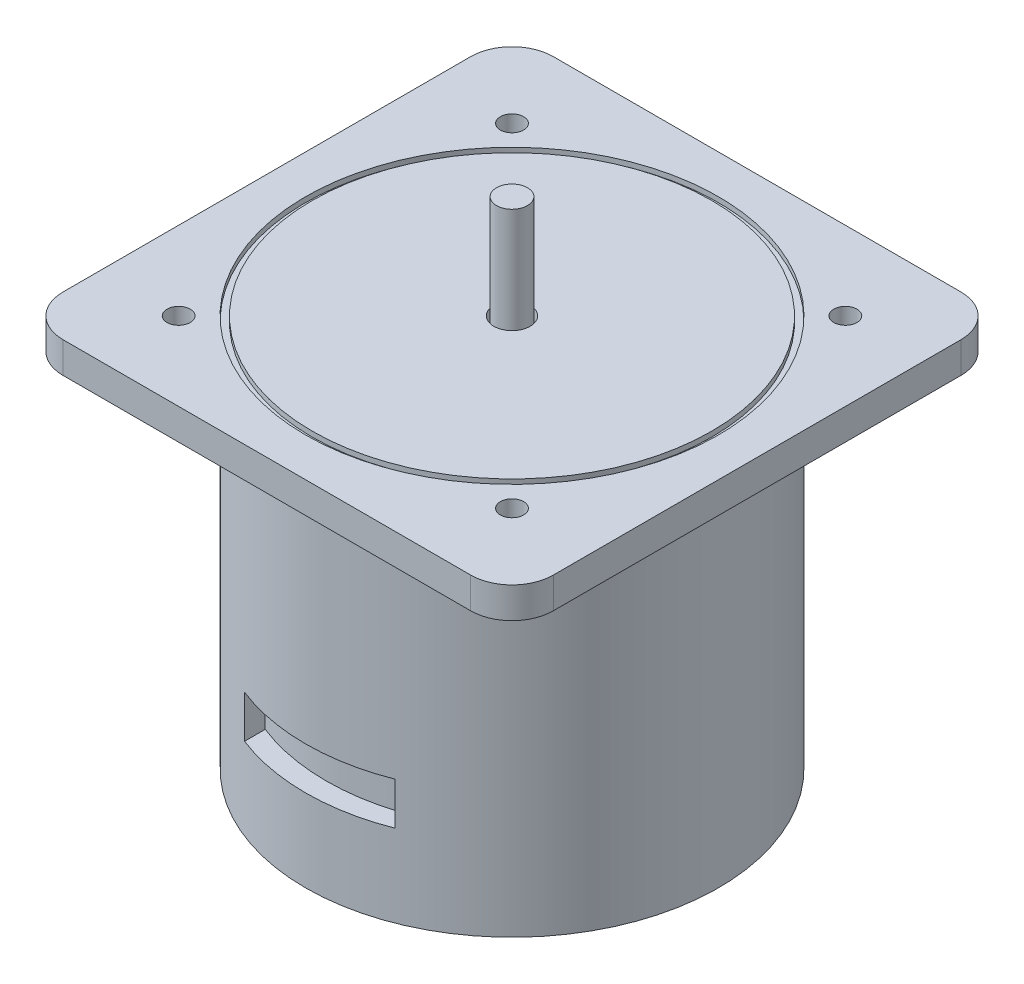
ISO-10303-21;
HEADER;
FILE_DESCRIPTION(('STEP AP214'),'2;1');
FILE_NAME('part.step','',(''),(''),'','','');
FILE_SCHEMA(('AUTOMOTIVE_DESIGN { 1 0 10303 214 1 1 1 1 }'));
ENDSEC;
DATA;
#1=APPLICATION_CONTEXT('core data for automotive mechanical design processes');
#2=APPLICATION_PROTOCOL_DEFINITION('international standard','automotive_design',2000,#1);
#3=PRODUCT_CONTEXT('',#1,'mechanical');
#4=PRODUCT('Part','Part','',(#3));
#5=PRODUCT_RELATED_PRODUCT_CATEGORY('part','',(#4));
#6=PRODUCT_DEFINITION_FORMATION('','',#4);
#7=PRODUCT_DEFINITION_CONTEXT('part definition',#1,'design');
#8=PRODUCT_DEFINITION('design','',#6,#7);
#9=PRODUCT_DEFINITION_SHAPE('','',#8);
#10=(LENGTH_UNIT() NAMED_UNIT(*) SI_UNIT(.MILLI.,.METRE.));
#11=(NAMED_UNIT(*) PLANE_ANGLE_UNIT() SI_UNIT($,.RADIAN.));
#12=(NAMED_UNIT(*) SI_UNIT($,.STERADIAN.) SOLID_ANGLE_UNIT());
#13=UNCERTAINTY_MEASURE_WITH_UNIT(LENGTH_MEASURE(1.E-05),#10,'distance_accuracy_value','');
#14=(GEOMETRIC_REPRESENTATION_CONTEXT(3) GLOBAL_UNCERTAINTY_ASSIGNED_CONTEXT((#13)) GLOBAL_UNIT_ASSIGNED_CONTEXT((#10,
#11,#12)) REPRESENTATION_CONTEXT('',''));
#15=CARTESIAN_POINT('',(0.,0.,0.));
#16=DIRECTION('',(0.,0.,1.));
#17=DIRECTION('',(1.,0.,0.));
#18=AXIS2_PLACEMENT_3D('',#15,#16,#17);
#19=CARTESIAN_POINT('',(0.,0.,0.));
#20=DIRECTION('',(0.,1.,0.));
#21=DIRECTION('',(0.,0.,1.));
#22=AXIS2_PLACEMENT_3D('',#19,#20,#21);
#23=PLANE('',#22);
#24=CARTESIAN_POINT('',(22.4964510362882,0.,0.));
#25=DIRECTION('',(0.,1.,0.));
#26=DIRECTION('',(0.,0.,-1.));
#27=AXIS2_PLACEMENT_3D('',#24,#25,#26);
#28=CIRCLE('',#27,5.38478881187688);
#29=CARTESIAN_POINT('',(25.6226762505398,0.,-4.38436614099365));
#30=VERTEX_POINT('',#29);
#31=CARTESIAN_POINT('',(25.77290034815,0.,4.27326929356368));
#32=VERTEX_POINT('',#31);
#33=EDGE_CURVE('E205',#30,#32,#28,.F.);
#34=ORIENTED_EDGE('',*,*,#33,.T.);
#35=DIRECTION('',(0.608463846276613,0.,0.793581594906454));
#36=VECTOR('',#35,1.);
#37=CARTESIAN_POINT('',(14.1676292878415,0.,-10.862764792469));
#38=LINE('',#37,#36);
#39=CARTESIAN_POINT('',(27.3190931834106,0.,6.28987255396704));
#40=VERTEX_POINT('',#39);
#41=EDGE_CURVE('E179',#32,#40,#38,.T.);
#42=ORIENTED_EDGE('',*,*,#41,.T.);
#43=CARTESIAN_POINT('',(22.4964510362882,0.,0.));
#44=DIRECTION('',(0.,1.,0.));
#45=DIRECTION('',(0.,0.,-1.));
#46=AXIS2_PLACEMENT_3D('',#43,#44,#45);
#47=CIRCLE('',#46,7.92593048318929);
#48=CARTESIAN_POINT('',(27.0979766649814,0.,-6.45339723810865));
#49=VERTEX_POINT('',#48);
#50=EDGE_CURVE('E193',#40,#49,#47,.T.);
#51=ORIENTED_EDGE('',*,*,#50,.T.);
#52=DIRECTION('',(0.58056598382398,0.,-0.814213202070867));
#53=VECTOR('',#52,1.);
#54=CARTESIAN_POINT('',(14.9138678534548,0.,10.634173384735));
#55=LINE('',#54,#53);
#56=EDGE_CURVE('E51',#30,#49,#55,.T.);
#57=ORIENTED_EDGE('',*,*,#56,.F.);
#58=EDGE_LOOP('',(#34,#42,#51,#57));
#59=FACE_BOUND('',#58,.T.);
#60=CARTESIAN_POINT('',(0.,0.,0.));
#61=DIRECTION('',(0.,1.,0.));
#62=DIRECTION('',(0.,0.,1.));
#63=AXIS2_PLACEMENT_3D('',#60,#61,#62);
#64=CIRCLE('',#63,40.);
#65=CARTESIAN_POINT('',(0.,0.,40.));
#66=VERTEX_POINT('',#65);
#67=EDGE_CURVE('E313',#66,#66,#64,.T.);
#68=ORIENTED_EDGE('',*,*,#67,.F.);
#69=EDGE_LOOP('',(#68));
#70=FACE_BOUND('',#69,.T.);
#71=DIRECTION('',(-0.608463846276613,0.,0.793581594906454));
#72=VECTOR('',#71,1.);
#73=CARTESIAN_POINT('',(-14.1676292878415,0.,-10.862764792469));
#74=LINE('',#73,#72);
#75=CARTESIAN_POINT('',(-25.77290034815,0.,4.27326929356368));
#76=VERTEX_POINT('',#75);
#77=CARTESIAN_POINT('',(-27.3190931834106,0.,6.28987255396704));
#78=VERTEX_POINT('',#77);
#79=EDGE_CURVE('E184',#76,#78,#74,.T.);
#80=ORIENTED_EDGE('',*,*,#79,.F.);
#81=CARTESIAN_POINT('',(-22.4964510362882,0.,0.));
#82=DIRECTION('',(0.,-1.,0.));
#83=DIRECTION('',(0.,0.,-1.));
#84=AXIS2_PLACEMENT_3D('',#81,#82,#83);
#85=CIRCLE('',#84,5.38478881187688);
#86=CARTESIAN_POINT('',(-25.6226762505398,0.,-4.38436614099365));
#87=VERTEX_POINT('',#86);
#88=EDGE_CURVE('E218',#87,#76,#85,.F.);
#89=ORIENTED_EDGE('',*,*,#88,.F.);
#90=DIRECTION('',(-0.58056598382398,0.,-0.814213202070867));
#91=VECTOR('',#90,1.);
#92=CARTESIAN_POINT('',(-14.9138678534548,0.,10.634173384735));
#93=LINE('',#92,#91);
#94=CARTESIAN_POINT('',(-27.0979766649814,0.,-6.45339723810865));
#95=VERTEX_POINT('',#94);
#96=EDGE_CURVE('E229',#87,#95,#93,.T.);
#97=ORIENTED_EDGE('',*,*,#96,.T.);
#98=CARTESIAN_POINT('',(-22.4964510362882,0.,0.));
#99=DIRECTION('',(0.,-1.,0.));
#100=DIRECTION('',(0.,0.,-1.));
#101=AXIS2_PLACEMENT_3D('',#98,#99,#100);
#102=CIRCLE('',#101,7.92593048318929);
#103=EDGE_CURVE('E59',#78,#95,#102,.T.);
#104=ORIENTED_EDGE('',*,*,#103,.F.);
#105=EDGE_LOOP('',(#80,#89,#97,#104));
#106=FACE_BOUND('',#105,.T.);
#107=ADVANCED_FACE('F34',(#59,#70,#106),#23,.F.);
#108=CARTESIAN_POINT('',(0.,70.,0.));
#109=DIRECTION('',(0.,-1.,0.));
#110=DIRECTION('',(0.,0.,-1.));
#111=AXIS2_PLACEMENT_3D('',#108,#109,#110);
#112=CYLINDRICAL_SURFACE('',#111,40.);
#113=ORIENTED_EDGE('',*,*,#67,.T.);
#114=EDGE_LOOP('',(#113));
#115=FACE_BOUND('',#114,.T.);
#116=CARTESIAN_POINT('',(0.,70.,0.));
#117=DIRECTION('',(0.,1.,0.));
#118=DIRECTION('',(0.,0.,1.));
#119=AXIS2_PLACEMENT_3D('',#116,#117,#118);
#120=CIRCLE('',#119,40.);
#121=CARTESIAN_POINT('',(0.,70.,40.));
#122=VERTEX_POINT('',#121);
#123=EDGE_CURVE('E324',#122,#122,#120,.T.);
#124=ORIENTED_EDGE('',*,*,#123,.F.);
#125=EDGE_LOOP('',(#124));
#126=FACE_BOUND('',#125,.T.);
#127=DIRECTION('',(0.,-1.,0.));
#128=VECTOR('',#127,1.);
#129=CARTESIAN_POINT('',(-14.5735687844263,70.,37.2506522477875));
#130=LINE('',#129,#128);
#131=CARTESIAN_POINT('',(-14.5735687844263,24.166302971847,37.2506522477875));
#132=VERTEX_POINT('',#131);
#133=CARTESIAN_POINT('',(-14.5735687844263,15.945315452427,37.2506522477875));
#134=VERTEX_POINT('',#133);
#135=EDGE_CURVE('E257',#132,#134,#130,.T.);
#136=ORIENTED_EDGE('',*,*,#135,.F.);
#137=CARTESIAN_POINT('',(0.,24.166302971847,0.));
#138=DIRECTION('',(0.,-1.,0.));
#139=DIRECTION('',(0.,0.,-1.));
#140=AXIS2_PLACEMENT_3D('',#137,#138,#139);
#141=CIRCLE('',#140,40.);
#142=CARTESIAN_POINT('',(14.5735687844263,24.166302971847,37.2506522477875));
#143=VERTEX_POINT('',#142);
#144=EDGE_CURVE('E253',#143,#132,#141,.T.);
#145=ORIENTED_EDGE('',*,*,#144,.F.);
#146=DIRECTION('',(0.,-1.,0.));
#147=VECTOR('',#146,1.);
#148=CARTESIAN_POINT('',(14.5735687844263,70.,37.2506522477875));
#149=LINE('',#148,#147);
#150=CARTESIAN_POINT('',(14.5735687844263,15.945315452427,37.2506522477875));
#151=VERTEX_POINT('',#150);
#152=EDGE_CURVE('E248',#143,#151,#149,.T.);
#153=ORIENTED_EDGE('',*,*,#152,.T.);
#154=CARTESIAN_POINT('',(0.,15.945315452427,0.));
#155=DIRECTION('',(0.,1.,0.));
#156=DIRECTION('',(0.,0.,1.));
#157=AXIS2_PLACEMENT_3D('',#154,#155,#156);
#158=CIRCLE('',#157,40.);
#159=EDGE_CURVE('E244',#134,#151,#158,.T.);
#160=ORIENTED_EDGE('',*,*,#159,.F.);
#161=EDGE_LOOP('',(#136,#145,#153,#160));
#162=FACE_BOUND('',#161,.T.);
#163=ADVANCED_FACE('F391',(#115,#126,#162),#112,.T.);
#164=CARTESIAN_POINT('',(47.5,76.,-47.5));
#165=DIRECTION('',(-1.,0.,0.));
#166=DIRECTION('',(0.,0.,1.));
#167=AXIS2_PLACEMENT_3D('',#164,#165,#166);
#168=PLANE('',#167);
#169=DIRECTION('',(0.,0.,-1.));
#170=VECTOR('',#169,1.);
#171=CARTESIAN_POINT('',(47.5,76.,-47.5));
#172=LINE('',#171,#170);
#173=CARTESIAN_POINT('',(47.5,76.,39.5));
#174=VERTEX_POINT('',#173);
#175=CARTESIAN_POINT('',(47.5,76.,-39.5));
#176=VERTEX_POINT('',#175);
#177=EDGE_CURVE('E300',#174,#176,#172,.T.);
#178=ORIENTED_EDGE('',*,*,#177,.F.);
#179=DIRECTION('',(0.,-1.,0.));
#180=VECTOR('',#179,1.);
#181=CARTESIAN_POINT('',(47.5,76.,39.5));
#182=LINE('',#181,#180);
#183=CARTESIAN_POINT('',(47.5,70.,39.5));
#184=VERTEX_POINT('',#183);
#185=EDGE_CURVE('E331',#174,#184,#182,.T.);
#186=ORIENTED_EDGE('',*,*,#185,.T.);
#187=DIRECTION('',(0.,0.,-1.));
#188=VECTOR('',#187,1.);
#189=CARTESIAN_POINT('',(47.5,70.,-47.5));
#190=LINE('',#189,#188);
#191=CARTESIAN_POINT('',(47.5,70.,-39.5));
#192=VERTEX_POINT('',#191);
#193=EDGE_CURVE('E297',#184,#192,#190,.T.);
#194=ORIENTED_EDGE('',*,*,#193,.T.);
#195=DIRECTION('',(0.,-1.,0.));
#196=VECTOR('',#195,1.);
#197=CARTESIAN_POINT('',(47.5,76.,-39.5));
#198=LINE('',#197,#196);
#199=EDGE_CURVE('E327',#192,#176,#198,.F.);
#200=ORIENTED_EDGE('',*,*,#199,.T.);
#201=EDGE_LOOP('',(#178,#186,#194,#200));
#202=FACE_BOUND('',#201,.T.);
#203=ADVANCED_FACE('F397',(#202),#168,.F.);
#204=CARTESIAN_POINT('',(-47.5,76.,-47.5));
#205=DIRECTION('',(0.,0.,1.));
#206=DIRECTION('',(1.,0.,0.));
#207=AXIS2_PLACEMENT_3D('',#204,#205,#206);
#208=PLANE('',#207);
#209=DIRECTION('',(-1.,0.,0.));
#210=VECTOR('',#209,1.);
#211=CARTESIAN_POINT('',(-47.5,70.,-47.5));
#212=LINE('',#211,#210);
#213=CARTESIAN_POINT('',(39.5,70.,-47.5));
#214=VERTEX_POINT('',#213);
#215=CARTESIAN_POINT('',(-39.5,70.,-47.5));
#216=VERTEX_POINT('',#215);
#217=EDGE_CURVE('E316',#214,#216,#212,.T.);
#218=ORIENTED_EDGE('',*,*,#217,.T.);
#219=DIRECTION('',(0.,-1.,0.));
#220=VECTOR('',#219,1.);
#221=CARTESIAN_POINT('',(-39.5,76.,-47.5));
#222=LINE('',#221,#220);
#223=CARTESIAN_POINT('',(-39.5,76.,-47.5));
#224=VERTEX_POINT('',#223);
#225=EDGE_CURVE('E11',#216,#224,#222,.F.);
#226=ORIENTED_EDGE('',*,*,#225,.T.);
#227=DIRECTION('',(-1.,0.,0.));
#228=VECTOR('',#227,1.);
#229=CARTESIAN_POINT('',(-47.5,76.,-47.5));
#230=LINE('',#229,#228);
#231=CARTESIAN_POINT('',(39.5,76.,-47.5));
#232=VERTEX_POINT('',#231);
#233=EDGE_CURVE('E303',#232,#224,#230,.T.);
#234=ORIENTED_EDGE('',*,*,#233,.F.);
#235=DIRECTION('',(0.,-1.,0.));
#236=VECTOR('',#235,1.);
#237=CARTESIAN_POINT('',(39.5,76.,-47.5));
#238=LINE('',#237,#236);
#239=EDGE_CURVE('E43',#232,#214,#238,.T.);
#240=ORIENTED_EDGE('',*,*,#239,.T.);
#241=EDGE_LOOP('',(#218,#226,#234,#240));
#242=FACE_BOUND('',#241,.T.);
#243=ADVANCED_FACE('F447',(#242),#208,.F.);
#244=CARTESIAN_POINT('',(-47.5,76.,-47.5));
#245=DIRECTION('',(1.,0.,0.));
#246=DIRECTION('',(0.,0.,-1.));
#247=AXIS2_PLACEMENT_3D('',#244,#245,#246);
#248=PLANE('',#247);
#249=DIRECTION('',(0.,0.,1.));
#250=VECTOR('',#249,1.);
#251=CARTESIAN_POINT('',(-47.5,70.,-47.5));
#252=LINE('',#251,#250);
#253=CARTESIAN_POINT('',(-47.5,70.,-39.5));
#254=VERTEX_POINT('',#253);
#255=CARTESIAN_POINT('',(-47.5,70.,39.5));
#256=VERTEX_POINT('',#255);
#257=EDGE_CURVE('E319',#254,#256,#252,.T.);
#258=ORIENTED_EDGE('',*,*,#257,.T.);
#259=DIRECTION('',(0.,-1.,0.));
#260=VECTOR('',#259,1.);
#261=CARTESIAN_POINT('',(-47.5,76.,39.5));
#262=LINE('',#261,#260);
#263=CARTESIAN_POINT('',(-47.5,76.,39.5));
#264=VERTEX_POINT('',#263);
#265=EDGE_CURVE('E358',#256,#264,#262,.F.);
#266=ORIENTED_EDGE('',*,*,#265,.T.);
#267=DIRECTION('',(0.,0.,1.));
#268=VECTOR('',#267,1.);
#269=CARTESIAN_POINT('',(-47.5,76.,-47.5));
#270=LINE('',#269,#268);
#271=CARTESIAN_POINT('',(-47.5,76.,-39.5));
#272=VERTEX_POINT('',#271);
#273=EDGE_CURVE('E307',#272,#264,#270,.T.);
#274=ORIENTED_EDGE('',*,*,#273,.F.);
#275=DIRECTION('',(0.,-1.,0.));
#276=VECTOR('',#275,1.);
#277=CARTESIAN_POINT('',(-47.5,76.,-39.5));
#278=LINE('',#277,#276);
#279=EDGE_CURVE('E355',#272,#254,#278,.T.);
#280=ORIENTED_EDGE('',*,*,#279,.T.);
#281=EDGE_LOOP('',(#258,#266,#274,#280));
#282=FACE_BOUND('',#281,.T.);
#283=ADVANCED_FACE('F429',(#282),#248,.F.);
#284=CARTESIAN_POINT('',(-47.5,76.,47.5));
#285=DIRECTION('',(0.,0.,-1.));
#286=DIRECTION('',(-1.,0.,0.));
#287=AXIS2_PLACEMENT_3D('',#284,#285,#286);
#288=PLANE('',#287);
#289=DIRECTION('',(1.,0.,0.));
#290=VECTOR('',#289,1.);
#291=CARTESIAN_POINT('',(-47.5,70.,47.5));
#292=LINE('',#291,#290);
#293=CARTESIAN_POINT('',(-39.5,70.,47.5));
#294=VERTEX_POINT('',#293);
#295=CARTESIAN_POINT('',(39.5,70.,47.5));
#296=VERTEX_POINT('',#295);
#297=EDGE_CURVE('E304',#294,#296,#292,.T.);
#298=ORIENTED_EDGE('',*,*,#297,.T.);
#299=DIRECTION('',(0.,-1.,0.));
#300=VECTOR('',#299,1.);
#301=CARTESIAN_POINT('',(39.5,76.,47.5));
#302=LINE('',#301,#300);
#303=CARTESIAN_POINT('',(39.5,76.,47.5));
#304=VERTEX_POINT('',#303);
#305=EDGE_CURVE('E345',#296,#304,#302,.F.);
#306=ORIENTED_EDGE('',*,*,#305,.T.);
#307=DIRECTION('',(1.,0.,0.));
#308=VECTOR('',#307,1.);
#309=CARTESIAN_POINT('',(-47.5,76.,47.5));
#310=LINE('',#309,#308);
#311=CARTESIAN_POINT('',(-39.5,76.,47.5));
#312=VERTEX_POINT('',#311);
#313=EDGE_CURVE('E310',#312,#304,#310,.T.);
#314=ORIENTED_EDGE('',*,*,#313,.F.);
#315=DIRECTION('',(0.,-1.,0.));
#316=VECTOR('',#315,1.);
#317=CARTESIAN_POINT('',(-39.5,76.,47.5));
#318=LINE('',#317,#316);
#319=EDGE_CURVE('E342',#312,#294,#318,.T.);
#320=ORIENTED_EDGE('',*,*,#319,.T.);
#321=EDGE_LOOP('',(#298,#306,#314,#320));
#322=FACE_BOUND('',#321,.T.);
#323=ADVANCED_FACE('F436',(#322),#288,.F.);
#324=CARTESIAN_POINT('',(0.,76.,0.));
#325=DIRECTION('',(0.,1.,0.));
#326=DIRECTION('',(0.,0.,1.));
#327=AXIS2_PLACEMENT_3D('',#324,#325,#326);
#328=PLANE('',#327);
#329=CARTESIAN_POINT('',(-32.2955996908533,76.,32.2955996908551));
#330=DIRECTION('',(0.,1.,0.));
#331=DIRECTION('',(0.,0.,1.));
#332=AXIS2_PLACEMENT_3D('',#329,#330,#331);
#333=CIRCLE('',#332,2.25);
#334=CARTESIAN_POINT('',(-32.2955996908533,76.,34.5455996908551));
#335=VERTEX_POINT('',#334);
#336=EDGE_CURVE('E702',#335,#335,#333,.T.);
#337=ORIENTED_EDGE('',*,*,#336,.F.);
#338=EDGE_LOOP('',(#337));
#339=FACE_BOUND('',#338,.T.);
#340=CARTESIAN_POINT('',(32.295599690857,76.,32.2955996908533));
#341=DIRECTION('',(0.,1.,0.));
#342=DIRECTION('',(0.,0.,1.));
#343=AXIS2_PLACEMENT_3D('',#340,#341,#342);
#344=CIRCLE('',#343,2.25);
#345=CARTESIAN_POINT('',(32.295599690857,76.,34.5455996908533));
#346=VERTEX_POINT('',#345);
#347=EDGE_CURVE('E698',#346,#346,#344,.T.);
#348=ORIENTED_EDGE('',*,*,#347,.F.);
#349=EDGE_LOOP('',(#348));
#350=FACE_BOUND('',#349,.T.);
#351=CARTESIAN_POINT('',(32.2955996908551,76.,-32.295599690857));
#352=DIRECTION('',(0.,1.,0.));
#353=DIRECTION('',(0.,0.,1.));
#354=AXIS2_PLACEMENT_3D('',#351,#352,#353);
#355=CIRCLE('',#354,2.25);
#356=CARTESIAN_POINT('',(32.2955996908551,76.,-30.045599690857));
#357=VERTEX_POINT('',#356);
#358=EDGE_CURVE('E679',#357,#357,#355,.T.);
#359=ORIENTED_EDGE('',*,*,#358,.F.);
#360=EDGE_LOOP('',(#359));
#361=FACE_BOUND('',#360,.T.);
#362=CARTESIAN_POINT('',(-32.2955996908551,76.,-32.2955996908551));
#363=DIRECTION('',(0.,1.,0.));
#364=DIRECTION('',(0.,0.,1.));
#365=AXIS2_PLACEMENT_3D('',#362,#363,#364);
#366=CIRCLE('',#365,2.25);
#367=CARTESIAN_POINT('',(-32.2955996908551,76.,-30.0455996908551));
#368=VERTEX_POINT('',#367);
#369=EDGE_CURVE('E366',#368,#368,#366,.T.);
#370=ORIENTED_EDGE('',*,*,#369,.F.);
#371=EDGE_LOOP('',(#370));
#372=FACE_BOUND('',#371,.T.);
#373=CARTESIAN_POINT('',(0.,76.,0.));
#374=DIRECTION('',(0.,1.,0.));
#375=DIRECTION('',(0.,0.,1.));
#376=AXIS2_PLACEMENT_3D('',#373,#374,#375);
#377=CIRCLE('',#376,40.);
#378=CARTESIAN_POINT('',(0.,76.,40.));
#379=VERTEX_POINT('',#378);
#380=EDGE_CURVE('E291',#379,#379,#377,.T.);
#381=ORIENTED_EDGE('',*,*,#380,.F.);
#382=EDGE_LOOP('',(#381));
#383=FACE_BOUND('',#382,.T.);
#384=ORIENTED_EDGE('',*,*,#313,.T.);
#385=CARTESIAN_POINT('',(39.5,76.,39.5));
#386=DIRECTION('',(0.,1.,0.));
#387=DIRECTION('',(0.,0.,1.));
#388=AXIS2_PLACEMENT_3D('',#385,#386,#387);
#389=CIRCLE('',#388,8.);
#390=EDGE_CURVE('E353',#304,#174,#389,.T.);
#391=ORIENTED_EDGE('',*,*,#390,.T.);
#392=ORIENTED_EDGE('',*,*,#177,.T.);
#393=CARTESIAN_POINT('',(39.5,76.,-39.5));
#394=DIRECTION('',(0.,1.,0.));
#395=DIRECTION('',(0.,0.,1.));
#396=AXIS2_PLACEMENT_3D('',#393,#394,#395);
#397=CIRCLE('',#396,8.);
#398=EDGE_CURVE('E347',#176,#232,#397,.T.);
#399=ORIENTED_EDGE('',*,*,#398,.T.);
#400=ORIENTED_EDGE('',*,*,#233,.T.);
#401=CARTESIAN_POINT('',(-39.5,76.,-39.5));
#402=DIRECTION('',(0.,1.,0.));
#403=DIRECTION('',(0.,0.,1.));
#404=AXIS2_PLACEMENT_3D('',#401,#402,#403);
#405=CIRCLE('',#404,8.);
#406=EDGE_CURVE('E349',#224,#272,#405,.T.);
#407=ORIENTED_EDGE('',*,*,#406,.T.);
#408=ORIENTED_EDGE('',*,*,#273,.T.);
#409=CARTESIAN_POINT('',(-39.5,76.,39.5));
#410=DIRECTION('',(0.,1.,0.));
#411=DIRECTION('',(0.,0.,1.));
#412=AXIS2_PLACEMENT_3D('',#409,#410,#411);
#413=CIRCLE('',#412,8.);
#414=EDGE_CURVE('E351',#264,#312,#413,.T.);
#415=ORIENTED_EDGE('',*,*,#414,.T.);
#416=EDGE_LOOP('',(#384,#391,#392,#399,#400,#407,#408,#415));
#417=FACE_BOUND('',#416,.T.);
#418=ADVANCED_FACE('F425',(#339,#350,#361,#372,#383,#417),#328,.T.);
#419=CARTESIAN_POINT('',(0.,70.,0.));
#420=DIRECTION('',(0.,1.,0.));
#421=DIRECTION('',(0.,0.,1.));
#422=AXIS2_PLACEMENT_3D('',#419,#420,#421);
#423=PLANE('',#422);
#424=CARTESIAN_POINT('',(-32.2955996908533,70.,32.2955996908551));
#425=DIRECTION('',(0.,1.,0.));
#426=DIRECTION('',(0.,0.,1.));
#427=AXIS2_PLACEMENT_3D('',#424,#425,#426);
#428=CIRCLE('',#427,2.25);
#429=CARTESIAN_POINT('',(-32.2955996908533,70.,34.5455996908551));
#430=VERTEX_POINT('',#429);
#431=EDGE_CURVE('E38',#430,#430,#428,.T.);
#432=ORIENTED_EDGE('',*,*,#431,.T.);
#433=EDGE_LOOP('',(#432));
#434=FACE_BOUND('',#433,.T.);
#435=CARTESIAN_POINT('',(32.295599690857,70.,32.2955996908533));
#436=DIRECTION('',(0.,1.,0.));
#437=DIRECTION('',(0.,0.,1.));
#438=AXIS2_PLACEMENT_3D('',#435,#436,#437);
#439=CIRCLE('',#438,2.25);
#440=CARTESIAN_POINT('',(32.295599690857,70.,34.5455996908533));
#441=VERTEX_POINT('',#440);
#442=EDGE_CURVE('E368',#441,#441,#439,.T.);
#443=ORIENTED_EDGE('',*,*,#442,.T.);
#444=EDGE_LOOP('',(#443));
#445=FACE_BOUND('',#444,.T.);
#446=CARTESIAN_POINT('',(32.2955996908551,70.,-32.295599690857));
#447=DIRECTION('',(0.,1.,0.));
#448=DIRECTION('',(0.,0.,1.));
#449=AXIS2_PLACEMENT_3D('',#446,#447,#448);
#450=CIRCLE('',#449,2.25);
#451=CARTESIAN_POINT('',(32.2955996908551,70.,-30.045599690857));
#452=VERTEX_POINT('',#451);
#453=EDGE_CURVE('E365',#452,#452,#450,.T.);
#454=ORIENTED_EDGE('',*,*,#453,.T.);
#455=EDGE_LOOP('',(#454));
#456=FACE_BOUND('',#455,.T.);
#457=CARTESIAN_POINT('',(-32.2955996908551,70.,-32.2955996908551));
#458=DIRECTION('',(0.,1.,0.));
#459=DIRECTION('',(0.,0.,1.));
#460=AXIS2_PLACEMENT_3D('',#457,#458,#459);
#461=CIRCLE('',#460,2.25);
#462=CARTESIAN_POINT('',(-32.2955996908551,70.,-30.0455996908551));
#463=VERTEX_POINT('',#462);
#464=EDGE_CURVE('E362',#463,#463,#461,.T.);
#465=ORIENTED_EDGE('',*,*,#464,.T.);
#466=EDGE_LOOP('',(#465));
#467=FACE_BOUND('',#466,.T.);
#468=ORIENTED_EDGE('',*,*,#123,.T.);
#469=EDGE_LOOP('',(#468));
#470=FACE_BOUND('',#469,.T.);
#471=ORIENTED_EDGE('',*,*,#193,.F.);
#472=CARTESIAN_POINT('',(39.5,70.,39.5));
#473=DIRECTION('',(0.,1.,0.));
#474=DIRECTION('',(0.,0.,1.));
#475=AXIS2_PLACEMENT_3D('',#472,#473,#474);
#476=CIRCLE('',#475,8.);
#477=EDGE_CURVE('E340',#184,#296,#476,.F.);
#478=ORIENTED_EDGE('',*,*,#477,.T.);
#479=ORIENTED_EDGE('',*,*,#297,.F.);
#480=CARTESIAN_POINT('',(-39.5,70.,39.5));
#481=DIRECTION('',(0.,1.,0.));
#482=DIRECTION('',(0.,0.,1.));
#483=AXIS2_PLACEMENT_3D('',#480,#481,#482);
#484=CIRCLE('',#483,8.);
#485=EDGE_CURVE('E338',#294,#256,#484,.F.);
#486=ORIENTED_EDGE('',*,*,#485,.T.);
#487=ORIENTED_EDGE('',*,*,#257,.F.);
#488=CARTESIAN_POINT('',(-39.5,70.,-39.5));
#489=DIRECTION('',(0.,1.,0.));
#490=DIRECTION('',(0.,0.,1.));
#491=AXIS2_PLACEMENT_3D('',#488,#489,#490);
#492=CIRCLE('',#491,8.);
#493=EDGE_CURVE('E336',#254,#216,#492,.F.);
#494=ORIENTED_EDGE('',*,*,#493,.T.);
#495=ORIENTED_EDGE('',*,*,#217,.F.);
#496=CARTESIAN_POINT('',(39.5,70.,-39.5));
#497=DIRECTION('',(0.,1.,0.));
#498=DIRECTION('',(0.,0.,1.));
#499=AXIS2_PLACEMENT_3D('',#496,#497,#498);
#500=CIRCLE('',#499,8.);
#501=EDGE_CURVE('E334',#214,#192,#500,.F.);
#502=ORIENTED_EDGE('',*,*,#501,.T.);
#503=EDGE_LOOP('',(#471,#478,#479,#486,#487,#494,#495,#502));
#504=FACE_BOUND('',#503,.T.);
#505=ADVANCED_FACE('F375',(#434,#445,#456,#467,#470,#504),#423,.F.);
#506=CARTESIAN_POINT('',(0.,75.,0.));
#507=DIRECTION('',(0.,1.,0.));
#508=DIRECTION('',(0.,0.,1.));
#509=AXIS2_PLACEMENT_3D('',#506,#507,#508);
#510=CYLINDRICAL_SURFACE('',#509,40.);
#511=CARTESIAN_POINT('',(0.,75.,0.));
#512=DIRECTION('',(0.,1.,0.));
#513=DIRECTION('',(0.,0.,1.));
#514=AXIS2_PLACEMENT_3D('',#511,#512,#513);
#515=CIRCLE('',#514,40.);
#516=CARTESIAN_POINT('',(0.,75.,40.));
#517=VERTEX_POINT('',#516);
#518=EDGE_CURVE('E294',#517,#517,#515,.T.);
#519=ORIENTED_EDGE('',*,*,#518,.F.);
#520=EDGE_LOOP('',(#519));
#521=FACE_BOUND('',#520,.T.);
#522=ORIENTED_EDGE('',*,*,#380,.T.);
#523=EDGE_LOOP('',(#522));
#524=FACE_BOUND('',#523,.T.);
#525=ADVANCED_FACE('F451',(#521,#524),#510,.F.);
#526=CARTESIAN_POINT('',(0.,75.,0.));
#527=DIRECTION('',(0.,1.,0.));
#528=DIRECTION('',(0.,0.,1.));
#529=AXIS2_PLACEMENT_3D('',#526,#527,#528);
#530=PLANE('',#529);
#531=CARTESIAN_POINT('',(0.,75.,0.));
#532=DIRECTION('',(0.,1.,0.));
#533=DIRECTION('',(0.,0.,1.));
#534=AXIS2_PLACEMENT_3D('',#531,#532,#533);
#535=CIRCLE('',#534,38.7092730320655);
#536=CARTESIAN_POINT('',(0.,75.,38.7092730320655));
#537=VERTEX_POINT('',#536);
#538=EDGE_CURVE('E288',#537,#537,#535,.T.);
#539=ORIENTED_EDGE('',*,*,#538,.F.);
#540=EDGE_LOOP('',(#539));
#541=FACE_BOUND('',#540,.T.);
#542=ORIENTED_EDGE('',*,*,#518,.T.);
#543=EDGE_LOOP('',(#542));
#544=FACE_BOUND('',#543,.T.);
#545=ADVANCED_FACE('F457',(#541,#544),#530,.T.);
#546=CARTESIAN_POINT('',(0.,75.,0.));
#547=DIRECTION('',(0.,1.,0.));
#548=DIRECTION('',(0.,0.,1.));
#549=AXIS2_PLACEMENT_3D('',#546,#547,#548);
#550=CYLINDRICAL_SURFACE('',#549,38.7092730320655);
#551=ORIENTED_EDGE('',*,*,#538,.T.);
#552=EDGE_LOOP('',(#551));
#553=FACE_BOUND('',#552,.T.);
#554=CARTESIAN_POINT('',(0.,76.,0.));
#555=DIRECTION('',(0.,1.,0.));
#556=DIRECTION('',(0.,0.,1.));
#557=AXIS2_PLACEMENT_3D('',#554,#555,#556);
#558=CIRCLE('',#557,38.7092730320655);
#559=CARTESIAN_POINT('',(0.,76.,38.7092730320655));
#560=VERTEX_POINT('',#559);
#561=EDGE_CURVE('E287',#560,#560,#558,.T.);
#562=ORIENTED_EDGE('',*,*,#561,.F.);
#563=EDGE_LOOP('',(#562));
#564=FACE_BOUND('',#563,.T.);
#565=ADVANCED_FACE('F728',(#553,#564),#550,.T.);
#566=CARTESIAN_POINT('',(0.,76.,0.));
#567=DIRECTION('',(0.,1.,0.));
#568=DIRECTION('',(0.,0.,1.));
#569=AXIS2_PLACEMENT_3D('',#566,#567,#568);
#570=CIRCLE('',#569,3.51956070686339);
#571=CARTESIAN_POINT('',(0.,76.,3.51956070686339));
#572=VERTEX_POINT('',#571);
#573=EDGE_CURVE('E278',#572,#572,#570,.T.);
#574=ORIENTED_EDGE('',*,*,#573,.F.);
#575=EDGE_LOOP('',(#574));
#576=FACE_BOUND('',#575,.T.);
#577=ORIENTED_EDGE('',*,*,#561,.T.);
#578=EDGE_LOOP('',(#577));
#579=FACE_BOUND('',#578,.T.);
#580=ADVANCED_FACE('F408',(#576,#579),#328,.T.);
#581=CARTESIAN_POINT('',(39.5,76.,39.5));
#582=DIRECTION('',(0.,-1.,0.));
#583=DIRECTION('',(0.,0.,-1.));
#584=AXIS2_PLACEMENT_3D('',#581,#582,#583);
#585=CYLINDRICAL_SURFACE('',#584,8.);
#586=ORIENTED_EDGE('',*,*,#390,.F.);
#587=ORIENTED_EDGE('',*,*,#305,.F.);
#588=ORIENTED_EDGE('',*,*,#477,.F.);
#589=ORIENTED_EDGE('',*,*,#185,.F.);
#590=EDGE_LOOP('',(#586,#587,#588,#589));
#591=FACE_BOUND('',#590,.T.);
#592=ADVANCED_FACE('F404',(#591),#585,.T.);
#593=CARTESIAN_POINT('',(-39.5,76.,39.5));
#594=DIRECTION('',(0.,-1.,0.));
#595=DIRECTION('',(0.,0.,-1.));
#596=AXIS2_PLACEMENT_3D('',#593,#594,#595);
#597=CYLINDRICAL_SURFACE('',#596,8.);
#598=ORIENTED_EDGE('',*,*,#414,.F.);
#599=ORIENTED_EDGE('',*,*,#265,.F.);
#600=ORIENTED_EDGE('',*,*,#485,.F.);
#601=ORIENTED_EDGE('',*,*,#319,.F.);
#602=EDGE_LOOP('',(#598,#599,#600,#601));
#603=FACE_BOUND('',#602,.T.);
#604=ADVANCED_FACE('F407',(#603),#597,.T.);
#605=CARTESIAN_POINT('',(-39.5,76.,-39.5));
#606=DIRECTION('',(0.,-1.,0.));
#607=DIRECTION('',(0.,0.,-1.));
#608=AXIS2_PLACEMENT_3D('',#605,#606,#607);
#609=CYLINDRICAL_SURFACE('',#608,8.);
#610=ORIENTED_EDGE('',*,*,#406,.F.);
#611=ORIENTED_EDGE('',*,*,#225,.F.);
#612=ORIENTED_EDGE('',*,*,#493,.F.);
#613=ORIENTED_EDGE('',*,*,#279,.F.);
#614=EDGE_LOOP('',(#610,#611,#612,#613));
#615=FACE_BOUND('',#614,.T.);
#616=ADVANCED_FACE('F411',(#615),#609,.T.);
#617=CARTESIAN_POINT('',(39.5,76.,-39.5));
#618=DIRECTION('',(0.,-1.,0.));
#619=DIRECTION('',(0.,0.,-1.));
#620=AXIS2_PLACEMENT_3D('',#617,#618,#619);
#621=CYLINDRICAL_SURFACE('',#620,8.);
#622=ORIENTED_EDGE('',*,*,#398,.F.);
#623=ORIENTED_EDGE('',*,*,#199,.F.);
#624=ORIENTED_EDGE('',*,*,#501,.F.);
#625=ORIENTED_EDGE('',*,*,#239,.F.);
#626=EDGE_LOOP('',(#622,#623,#624,#625));
#627=FACE_BOUND('',#626,.T.);
#628=ADVANCED_FACE('F36',(#627),#621,.T.);
#629=CARTESIAN_POINT('',(0.,71.,0.));
#630=DIRECTION('',(0.,1.,0.));
#631=DIRECTION('',(0.,0.,1.));
#632=AXIS2_PLACEMENT_3D('',#629,#630,#631);
#633=CYLINDRICAL_SURFACE('',#632,3.51956070686339);
#634=CARTESIAN_POINT('',(0.,71.,0.));
#635=DIRECTION('',(0.,1.,0.));
#636=DIRECTION('',(0.,0.,1.));
#637=AXIS2_PLACEMENT_3D('',#634,#635,#636);
#638=CIRCLE('',#637,3.51956070686339);
#639=CARTESIAN_POINT('',(0.,71.,3.51956070686339));
#640=VERTEX_POINT('',#639);
#641=EDGE_CURVE('E279',#640,#640,#638,.T.);
#642=ORIENTED_EDGE('',*,*,#641,.F.);
#643=EDGE_LOOP('',(#642));
#644=FACE_BOUND('',#643,.T.);
#645=ORIENTED_EDGE('',*,*,#573,.T.);
#646=EDGE_LOOP('',(#645));
#647=FACE_BOUND('',#646,.T.);
#648=ADVANCED_FACE('F418',(#644,#647),#633,.F.);
#649=CARTESIAN_POINT('',(0.,71.,0.));
#650=DIRECTION('',(0.,1.,0.));
#651=DIRECTION('',(0.,0.,1.));
#652=AXIS2_PLACEMENT_3D('',#649,#650,#651);
#653=PLANE('',#652);
#654=CARTESIAN_POINT('',(0.,71.,0.));
#655=DIRECTION('',(0.,1.,0.));
#656=DIRECTION('',(0.,0.,1.));
#657=AXIS2_PLACEMENT_3D('',#654,#655,#656);
#658=CIRCLE('',#657,3.);
#659=CARTESIAN_POINT('',(0.,71.,3.));
#660=VERTEX_POINT('',#659);
#661=EDGE_CURVE('E246',#660,#660,#658,.T.);
#662=ORIENTED_EDGE('',*,*,#661,.F.);
#663=EDGE_LOOP('',(#662));
#664=FACE_BOUND('',#663,.T.);
#665=ORIENTED_EDGE('',*,*,#641,.T.);
#666=EDGE_LOOP('',(#665));
#667=FACE_BOUND('',#666,.T.);
#668=ADVANCED_FACE('F715',(#664,#667),#653,.T.);
#669=CARTESIAN_POINT('',(0.,96.,0.));
#670=DIRECTION('',(0.,1.,0.));
#671=DIRECTION('',(0.,0.,1.));
#672=AXIS2_PLACEMENT_3D('',#669,#670,#671);
#673=PLANE('',#672);
#674=CARTESIAN_POINT('',(0.,96.,0.));
#675=DIRECTION('',(0.,1.,0.));
#676=DIRECTION('',(0.,0.,1.));
#677=AXIS2_PLACEMENT_3D('',#674,#675,#676);
#678=CIRCLE('',#677,3.);
#679=CARTESIAN_POINT('',(0.,96.,3.));
#680=VERTEX_POINT('',#679);
#681=EDGE_CURVE('E282',#680,#680,#678,.T.);
#682=ORIENTED_EDGE('',*,*,#681,.T.);
#683=EDGE_LOOP('',(#682));
#684=FACE_BOUND('',#683,.T.);
#685=ADVANCED_FACE('F718',(#684),#673,.T.);
#686=CARTESIAN_POINT('',(0.,96.,0.));
#687=DIRECTION('',(0.,-1.,0.));
#688=DIRECTION('',(0.,0.,-1.));
#689=AXIS2_PLACEMENT_3D('',#686,#687,#688);
#690=CYLINDRICAL_SURFACE('',#689,3.);
#691=ORIENTED_EDGE('',*,*,#681,.F.);
#692=EDGE_LOOP('',(#691));
#693=FACE_BOUND('',#692,.T.);
#694=ORIENTED_EDGE('',*,*,#661,.T.);
#695=EDGE_LOOP('',(#694));
#696=FACE_BOUND('',#695,.T.);
#697=ADVANCED_FACE('F485',(#693,#696),#690,.T.);
#698=CARTESIAN_POINT('',(0.,70.,-4.));
#699=DIRECTION('',(0.,-1.,0.));
#700=DIRECTION('',(0.,0.,-1.));
#701=AXIS2_PLACEMENT_3D('',#698,#699,#700);
#702=CYLINDRICAL_SURFACE('',#701,40.);
#703=DIRECTION('',(0.,-1.,0.));
#704=VECTOR('',#703,1.);
#705=CARTESIAN_POINT('',(-14.5735687844263,70.,33.2506522477875));
#706=LINE('',#705,#704);
#707=CARTESIAN_POINT('',(-14.5735687844263,24.166302971847,33.2506522477875));
#708=VERTEX_POINT('',#707);
#709=CARTESIAN_POINT('',(-14.5735687844263,15.945315452427,33.2506522477875));
#710=VERTEX_POINT('',#709);
#711=EDGE_CURVE('E243',#708,#710,#706,.T.);
#712=ORIENTED_EDGE('',*,*,#711,.T.);
#713=CARTESIAN_POINT('',(0.,15.945315452427,-4.));
#714=DIRECTION('',(0.,1.,0.));
#715=DIRECTION('',(0.,0.,1.));
#716=AXIS2_PLACEMENT_3D('',#713,#714,#715);
#717=CIRCLE('',#716,40.);
#718=CARTESIAN_POINT('',(14.5735687844263,15.945315452427,33.2506522477875));
#719=VERTEX_POINT('',#718);
#720=EDGE_CURVE('E247',#710,#719,#717,.T.);
#721=ORIENTED_EDGE('',*,*,#720,.T.);
#722=DIRECTION('',(0.,-1.,0.));
#723=VECTOR('',#722,1.);
#724=CARTESIAN_POINT('',(14.5735687844263,70.,33.2506522477875));
#725=LINE('',#724,#723);
#726=CARTESIAN_POINT('',(14.5735687844263,24.166302971847,33.2506522477875));
#727=VERTEX_POINT('',#726);
#728=EDGE_CURVE('E252',#727,#719,#725,.T.);
#729=ORIENTED_EDGE('',*,*,#728,.F.);
#730=CARTESIAN_POINT('',(0.,24.166302971847,-4.));
#731=DIRECTION('',(0.,-1.,0.));
#732=DIRECTION('',(0.,0.,-1.));
#733=AXIS2_PLACEMENT_3D('',#730,#731,#732);
#734=CIRCLE('',#733,40.);
#735=EDGE_CURVE('E265',#727,#708,#734,.T.);
#736=ORIENTED_EDGE('',*,*,#735,.T.);
#737=EDGE_LOOP('',(#712,#721,#729,#736));
#738=FACE_BOUND('',#737,.T.);
#739=ADVANCED_FACE('F489',(#738),#702,.T.);
#740=CARTESIAN_POINT('',(-14.5735687844263,70.,37.2506522477875));
#741=DIRECTION('',(1.,0.,0.));
#742=DIRECTION('',(0.,0.,-1.));
#743=AXIS2_PLACEMENT_3D('',#740,#741,#742);
#744=PLANE('',#743);
#745=ORIENTED_EDGE('',*,*,#711,.F.);
#746=DIRECTION('',(0.,0.,-1.));
#747=VECTOR('',#746,1.);
#748=CARTESIAN_POINT('',(-14.5735687844263,24.166302971847,37.2506522477875));
#749=LINE('',#748,#747);
#750=EDGE_CURVE('E261',#132,#708,#749,.T.);
#751=ORIENTED_EDGE('',*,*,#750,.F.);
#752=ORIENTED_EDGE('',*,*,#135,.T.);
#753=DIRECTION('',(0.,0.,-1.));
#754=VECTOR('',#753,1.);
#755=CARTESIAN_POINT('',(-14.5735687844263,15.945315452427,37.2506522477875));
#756=LINE('',#755,#754);
#757=EDGE_CURVE('E260',#134,#710,#756,.T.);
#758=ORIENTED_EDGE('',*,*,#757,.T.);
#759=EDGE_LOOP('',(#745,#751,#752,#758));
#760=FACE_BOUND('',#759,.T.);
#761=ADVANCED_FACE('F493',(#760),#744,.T.);
#762=CARTESIAN_POINT('',(-14.5735687844263,24.166302971847,37.2506522477875));
#763=DIRECTION('',(0.,-1.,0.));
#764=DIRECTION('',(0.,0.,-1.));
#765=AXIS2_PLACEMENT_3D('',#762,#763,#764);
#766=PLANE('',#765);
#767=ORIENTED_EDGE('',*,*,#735,.F.);
#768=DIRECTION('',(0.,0.,-1.));
#769=VECTOR('',#768,1.);
#770=CARTESIAN_POINT('',(14.5735687844263,24.166302971847,37.2506522477875));
#771=LINE('',#770,#769);
#772=EDGE_CURVE('E256',#143,#727,#771,.T.);
#773=ORIENTED_EDGE('',*,*,#772,.F.);
#774=ORIENTED_EDGE('',*,*,#144,.T.);
#775=ORIENTED_EDGE('',*,*,#750,.T.);
#776=EDGE_LOOP('',(#767,#773,#774,#775));
#777=FACE_BOUND('',#776,.T.);
#778=ADVANCED_FACE('F504',(#777),#766,.T.);
#779=CARTESIAN_POINT('',(14.5735687844263,15.945315452427,37.2506522477875));
#780=DIRECTION('',(0.,1.,0.));
#781=DIRECTION('',(0.,0.,1.));
#782=AXIS2_PLACEMENT_3D('',#779,#780,#781);
#783=PLANE('',#782);
#784=ORIENTED_EDGE('',*,*,#720,.F.);
#785=ORIENTED_EDGE('',*,*,#757,.F.);
#786=ORIENTED_EDGE('',*,*,#159,.T.);
#787=DIRECTION('',(0.,0.,-1.));
#788=VECTOR('',#787,1.);
#789=CARTESIAN_POINT('',(14.5735687844263,15.945315452427,37.2506522477875));
#790=LINE('',#789,#788);
#791=EDGE_CURVE('E251',#151,#719,#790,.T.);
#792=ORIENTED_EDGE('',*,*,#791,.T.);
#793=EDGE_LOOP('',(#784,#785,#786,#792));
#794=FACE_BOUND('',#793,.T.);
#795=ADVANCED_FACE('F514',(#794),#783,.T.);
#796=CARTESIAN_POINT('',(14.5735687844263,70.,37.2506522477875));
#797=DIRECTION('',(1.,0.,0.));
#798=DIRECTION('',(0.,0.,-1.));
#799=AXIS2_PLACEMENT_3D('',#796,#797,#798);
#800=PLANE('',#799);
#801=ORIENTED_EDGE('',*,*,#728,.T.);
#802=ORIENTED_EDGE('',*,*,#791,.F.);
#803=ORIENTED_EDGE('',*,*,#152,.F.);
#804=ORIENTED_EDGE('',*,*,#772,.T.);
#805=EDGE_LOOP('',(#801,#802,#803,#804));
#806=FACE_BOUND('',#805,.T.);
#807=ADVANCED_FACE('F524',(#806),#800,.F.);
#808=CARTESIAN_POINT('',(-14.1676292878415,-4.,-10.862764792469));
#809=DIRECTION('',(-0.793581594906454,0.,-0.608463846276613));
#810=DIRECTION('',(-0.608463846276613,0.,0.793581594906454));
#811=AXIS2_PLACEMENT_3D('',#808,#809,#810);
#812=PLANE('',#811);
#813=ORIENTED_EDGE('',*,*,#79,.T.);
#814=DIRECTION('',(0.,1.,0.));
#815=VECTOR('',#814,1.);
#816=CARTESIAN_POINT('',(-27.3190931834106,-4.,6.28987255396704));
#817=LINE('',#816,#815);
#818=CARTESIAN_POINT('',(-27.3190931834106,-4.,6.28987255396704));
#819=VERTEX_POINT('',#818);
#820=EDGE_CURVE('E241',#819,#78,#817,.T.);
#821=ORIENTED_EDGE('',*,*,#820,.F.);
#822=DIRECTION('',(-0.608463846276613,0.,0.793581594906454));
#823=VECTOR('',#822,1.);
#824=CARTESIAN_POINT('',(-14.1676292878415,-4.,-10.862764792469));
#825=LINE('',#824,#823);
#826=CARTESIAN_POINT('',(-25.77290034815,-4.,4.27326929356368));
#827=VERTEX_POINT('',#826);
#828=EDGE_CURVE('E214',#827,#819,#825,.T.);
#829=ORIENTED_EDGE('',*,*,#828,.F.);
#830=DIRECTION('',(0.,1.,0.));
#831=VECTOR('',#830,1.);
#832=CARTESIAN_POINT('',(-25.77290034815,-4.,4.27326929356368));
#833=LINE('',#832,#831);
#834=EDGE_CURVE('E225',#827,#76,#833,.T.);
#835=ORIENTED_EDGE('',*,*,#834,.T.);
#836=EDGE_LOOP('',(#813,#821,#829,#835));
#837=FACE_BOUND('',#836,.T.);
#838=ADVANCED_FACE('F496',(#837),#812,.F.);
#839=CARTESIAN_POINT('',(-22.4964510362882,-4.,0.));
#840=DIRECTION('',(0.,1.,0.));
#841=DIRECTION('',(0.,0.,1.));
#842=AXIS2_PLACEMENT_3D('',#839,#840,#841);
#843=CYLINDRICAL_SURFACE('',#842,7.92593048318929);
#844=ORIENTED_EDGE('',*,*,#103,.T.);
#845=DIRECTION('',(0.,1.,0.));
#846=VECTOR('',#845,1.);
#847=CARTESIAN_POINT('',(-27.0979766649814,-4.,-6.45339723810864));
#848=LINE('',#847,#846);
#849=CARTESIAN_POINT('',(-27.0979766649814,-4.,-6.45339723810864));
#850=VERTEX_POINT('',#849);
#851=EDGE_CURVE('E238',#850,#95,#848,.T.);
#852=ORIENTED_EDGE('',*,*,#851,.F.);
#853=CARTESIAN_POINT('',(-22.4964510362882,-4.,0.));
#854=DIRECTION('',(0.,-1.,0.));
#855=DIRECTION('',(0.,0.,-1.));
#856=AXIS2_PLACEMENT_3D('',#853,#854,#855);
#857=CIRCLE('',#856,7.92593048318929);
#858=EDGE_CURVE('E217',#819,#850,#857,.T.);
#859=ORIENTED_EDGE('',*,*,#858,.F.);
#860=ORIENTED_EDGE('',*,*,#820,.T.);
#861=EDGE_LOOP('',(#844,#852,#859,#860));
#862=FACE_BOUND('',#861,.T.);
#863=ADVANCED_FACE('F544',(#862),#843,.T.);
#864=CARTESIAN_POINT('',(-14.9138678534548,-4.,10.634173384735));
#865=DIRECTION('',(0.814213202070867,0.,-0.58056598382398));
#866=DIRECTION('',(-0.58056598382398,0.,-0.814213202070867));
#867=AXIS2_PLACEMENT_3D('',#864,#865,#866);
#868=PLANE('',#867);
#869=ORIENTED_EDGE('',*,*,#96,.F.);
#870=DIRECTION('',(0.,1.,0.));
#871=VECTOR('',#870,1.);
#872=CARTESIAN_POINT('',(-25.6226762505398,-4.,-4.38436614099365));
#873=LINE('',#872,#871);
#874=CARTESIAN_POINT('',(-25.6226762505398,-4.,-4.38436614099365));
#875=VERTEX_POINT('',#874);
#876=EDGE_CURVE('E235',#875,#87,#873,.T.);
#877=ORIENTED_EDGE('',*,*,#876,.F.);
#878=DIRECTION('',(-0.58056598382398,0.,-0.814213202070867));
#879=VECTOR('',#878,1.);
#880=CARTESIAN_POINT('',(-14.9138678534548,-4.,10.634173384735));
#881=LINE('',#880,#879);
#882=EDGE_CURVE('E220',#875,#850,#881,.T.);
#883=ORIENTED_EDGE('',*,*,#882,.T.);
#884=ORIENTED_EDGE('',*,*,#851,.T.);
#885=EDGE_LOOP('',(#869,#877,#883,#884));
#886=FACE_BOUND('',#885,.T.);
#887=ADVANCED_FACE('F555',(#886),#868,.T.);
#888=CARTESIAN_POINT('',(-22.4964510362882,-4.,0.));
#889=DIRECTION('',(0.,1.,0.));
#890=DIRECTION('',(0.,0.,1.));
#891=AXIS2_PLACEMENT_3D('',#888,#889,#890);
#892=CYLINDRICAL_SURFACE('',#891,5.38478881187688);
#893=ORIENTED_EDGE('',*,*,#88,.T.);
#894=ORIENTED_EDGE('',*,*,#834,.F.);
#895=CARTESIAN_POINT('',(-22.4964510362882,-4.,0.));
#896=DIRECTION('',(0.,-1.,0.));
#897=DIRECTION('',(0.,0.,-1.));
#898=AXIS2_PLACEMENT_3D('',#895,#896,#897);
#899=CIRCLE('',#898,5.38478881187688);
#900=EDGE_CURVE('E223',#875,#827,#899,.F.);
#901=ORIENTED_EDGE('',*,*,#900,.F.);
#902=ORIENTED_EDGE('',*,*,#876,.T.);
#903=EDGE_LOOP('',(#893,#894,#901,#902));
#904=FACE_BOUND('',#903,.T.);
#905=ADVANCED_FACE('F565',(#904),#892,.F.);
#906=CARTESIAN_POINT('',(0.,-4.,0.));
#907=DIRECTION('',(0.,-1.,0.));
#908=DIRECTION('',(0.,0.,-1.));
#909=AXIS2_PLACEMENT_3D('',#906,#907,#908);
#910=PLANE('',#909);
#911=ORIENTED_EDGE('',*,*,#828,.T.);
#912=ORIENTED_EDGE('',*,*,#858,.T.);
#913=ORIENTED_EDGE('',*,*,#882,.F.);
#914=ORIENTED_EDGE('',*,*,#900,.T.);
#915=EDGE_LOOP('',(#911,#912,#913,#914));
#916=FACE_BOUND('',#915,.T.);
#917=ADVANCED_FACE('F575',(#916),#910,.T.);
#918=CARTESIAN_POINT('',(14.1676292878415,-4.,-10.862764792469));
#919=DIRECTION('',(-0.793581594906454,0.,0.608463846276613));
#920=DIRECTION('',(0.608463846276613,0.,0.793581594906454));
#921=AXIS2_PLACEMENT_3D('',#918,#919,#920);
#922=PLANE('',#921);
#923=ORIENTED_EDGE('',*,*,#41,.F.);
#924=DIRECTION('',(0.,1.,0.));
#925=VECTOR('',#924,1.);
#926=CARTESIAN_POINT('',(25.77290034815,-4.,4.27326929356368));
#927=LINE('',#926,#925);
#928=CARTESIAN_POINT('',(25.77290034815,-4.,4.27326929356368));
#929=VERTEX_POINT('',#928);
#930=EDGE_CURVE('E173',#929,#32,#927,.T.);
#931=ORIENTED_EDGE('',*,*,#930,.F.);
#932=DIRECTION('',(0.608463846276613,0.,0.793581594906454));
#933=VECTOR('',#932,1.);
#934=CARTESIAN_POINT('',(14.1676292878415,-4.,-10.862764792469));
#935=LINE('',#934,#933);
#936=CARTESIAN_POINT('',(27.3190931834106,-4.,6.28987255396704));
#937=VERTEX_POINT('',#936);
#938=EDGE_CURVE('E176',#929,#937,#935,.T.);
#939=ORIENTED_EDGE('',*,*,#938,.T.);
#940=DIRECTION('',(0.,1.,0.));
#941=VECTOR('',#940,1.);
#942=CARTESIAN_POINT('',(27.3190931834106,-4.,6.28987255396704));
#943=LINE('',#942,#941);
#944=EDGE_CURVE('E203',#937,#40,#943,.T.);
#945=ORIENTED_EDGE('',*,*,#944,.T.);
#946=EDGE_LOOP('',(#923,#931,#939,#945));
#947=FACE_BOUND('',#946,.T.);
#948=ADVANCED_FACE('F175',(#947),#922,.T.);
#949=CARTESIAN_POINT('',(22.4964510362882,-4.,0.));
#950=DIRECTION('',(0.,1.,0.));
#951=DIRECTION('',(0.,0.,1.));
#952=AXIS2_PLACEMENT_3D('',#949,#950,#951);
#953=CYLINDRICAL_SURFACE('',#952,5.38478881187688);
#954=ORIENTED_EDGE('',*,*,#33,.F.);
#955=DIRECTION('',(0.,1.,0.));
#956=VECTOR('',#955,1.);
#957=CARTESIAN_POINT('',(25.6226762505398,-4.,-4.38436614099365));
#958=LINE('',#957,#956);
#959=CARTESIAN_POINT('',(25.6226762505398,-4.,-4.38436614099365));
#960=VERTEX_POINT('',#959);
#961=EDGE_CURVE('E185',#960,#30,#958,.T.);
#962=ORIENTED_EDGE('',*,*,#961,.F.);
#963=CARTESIAN_POINT('',(22.4964510362882,-4.,0.));
#964=DIRECTION('',(0.,1.,0.));
#965=DIRECTION('',(0.,0.,-1.));
#966=AXIS2_PLACEMENT_3D('',#963,#964,#965);
#967=CIRCLE('',#966,5.38478881187688);
#968=EDGE_CURVE('E190',#960,#929,#967,.F.);
#969=ORIENTED_EDGE('',*,*,#968,.T.);
#970=ORIENTED_EDGE('',*,*,#930,.T.);
#971=EDGE_LOOP('',(#954,#962,#969,#970));
#972=FACE_BOUND('',#971,.T.);
#973=ADVANCED_FACE('F195',(#972),#953,.F.);
#974=CARTESIAN_POINT('',(14.9138678534548,-4.,10.634173384735));
#975=DIRECTION('',(0.814213202070867,0.,0.58056598382398));
#976=DIRECTION('',(0.58056598382398,0.,-0.814213202070867));
#977=AXIS2_PLACEMENT_3D('',#974,#975,#976);
#978=PLANE('',#977);
#979=ORIENTED_EDGE('',*,*,#56,.T.);
#980=DIRECTION('',(0.,1.,0.));
#981=VECTOR('',#980,1.);
#982=CARTESIAN_POINT('',(27.0979766649814,-4.,-6.45339723810864));
#983=LINE('',#982,#981);
#984=CARTESIAN_POINT('',(27.0979766649814,-4.,-6.45339723810864));
#985=VERTEX_POINT('',#984);
#986=EDGE_CURVE('E211',#985,#49,#983,.T.);
#987=ORIENTED_EDGE('',*,*,#986,.F.);
#988=DIRECTION('',(0.58056598382398,0.,-0.814213202070867));
#989=VECTOR('',#988,1.);
#990=CARTESIAN_POINT('',(14.9138678534548,-4.,10.634173384735));
#991=LINE('',#990,#989);
#992=EDGE_CURVE('E197',#960,#985,#991,.T.);
#993=ORIENTED_EDGE('',*,*,#992,.F.);
#994=ORIENTED_EDGE('',*,*,#961,.T.);
#995=EDGE_LOOP('',(#979,#987,#993,#994));
#996=FACE_BOUND('',#995,.T.);
#997=ADVANCED_FACE('F605',(#996),#978,.F.);
#998=CARTESIAN_POINT('',(22.4964510362882,-4.,0.));
#999=DIRECTION('',(0.,1.,0.));
#1000=DIRECTION('',(0.,0.,1.));
#1001=AXIS2_PLACEMENT_3D('',#998,#999,#1000);
#1002=CYLINDRICAL_SURFACE('',#1001,7.92593048318929);
#1003=ORIENTED_EDGE('',*,*,#50,.F.);
#1004=ORIENTED_EDGE('',*,*,#944,.F.);
#1005=CARTESIAN_POINT('',(22.4964510362882,-4.,0.));
#1006=DIRECTION('',(0.,1.,0.));
#1007=DIRECTION('',(0.,0.,-1.));
#1008=AXIS2_PLACEMENT_3D('',#1005,#1006,#1007);
#1009=CIRCLE('',#1008,7.92593048318929);
#1010=EDGE_CURVE('E192',#937,#985,#1009,.T.);
#1011=ORIENTED_EDGE('',*,*,#1010,.T.);
#1012=ORIENTED_EDGE('',*,*,#986,.T.);
#1013=EDGE_LOOP('',(#1003,#1004,#1011,#1012));
#1014=FACE_BOUND('',#1013,.T.);
#1015=ADVANCED_FACE('F614',(#1014),#1002,.T.);
#1016=CARTESIAN_POINT('',(0.,-4.,0.));
#1017=DIRECTION('',(0.,-1.,0.));
#1018=DIRECTION('',(0.,0.,-1.));
#1019=AXIS2_PLACEMENT_3D('',#1016,#1017,#1018);
#1020=PLANE('',#1019);
#1021=ORIENTED_EDGE('',*,*,#938,.F.);
#1022=ORIENTED_EDGE('',*,*,#968,.F.);
#1023=ORIENTED_EDGE('',*,*,#992,.T.);
#1024=ORIENTED_EDGE('',*,*,#1010,.F.);
#1025=EDGE_LOOP('',(#1021,#1022,#1023,#1024));
#1026=FACE_BOUND('',#1025,.T.);
#1027=ADVANCED_FACE('F189',(#1026),#1020,.T.);
#1028=CARTESIAN_POINT('',(-32.2955996908551,42.,-32.2955996908551));
#1029=DIRECTION('',(0.,1.,0.));
#1030=DIRECTION('',(0.,0.,1.));
#1031=AXIS2_PLACEMENT_3D('',#1028,#1029,#1030);
#1032=CYLINDRICAL_SURFACE('',#1031,2.25);
#1033=ORIENTED_EDGE('',*,*,#369,.T.);
#1034=EDGE_LOOP('',(#1033));
#1035=FACE_BOUND('',#1034,.T.);
#1036=ORIENTED_EDGE('',*,*,#464,.F.);
#1037=EDGE_LOOP('',(#1036));
#1038=FACE_BOUND('',#1037,.T.);
#1039=ADVANCED_FACE('F633',(#1035,#1038),#1032,.F.);
#1040=CARTESIAN_POINT('',(32.2955996908551,42.,-32.295599690857));
#1041=DIRECTION('',(0.,1.,0.));
#1042=DIRECTION('',(0.,0.,1.));
#1043=AXIS2_PLACEMENT_3D('',#1040,#1041,#1042);
#1044=CYLINDRICAL_SURFACE('',#1043,2.25);
#1045=ORIENTED_EDGE('',*,*,#358,.T.);
#1046=EDGE_LOOP('',(#1045));
#1047=FACE_BOUND('',#1046,.T.);
#1048=ORIENTED_EDGE('',*,*,#453,.F.);
#1049=EDGE_LOOP('',(#1048));
#1050=FACE_BOUND('',#1049,.T.);
#1051=ADVANCED_FACE('F385',(#1047,#1050),#1044,.F.);
#1052=CARTESIAN_POINT('',(32.295599690857,42.,32.2955996908533));
#1053=DIRECTION('',(0.,1.,0.));
#1054=DIRECTION('',(0.,0.,1.));
#1055=AXIS2_PLACEMENT_3D('',#1052,#1053,#1054);
#1056=CYLINDRICAL_SURFACE('',#1055,2.25);
#1057=ORIENTED_EDGE('',*,*,#347,.T.);
#1058=EDGE_LOOP('',(#1057));
#1059=FACE_BOUND('',#1058,.T.);
#1060=ORIENTED_EDGE('',*,*,#442,.F.);
#1061=EDGE_LOOP('',(#1060));
#1062=FACE_BOUND('',#1061,.T.);
#1063=ADVANCED_FACE('F379',(#1059,#1062),#1056,.F.);
#1064=CARTESIAN_POINT('',(-32.2955996908533,42.,32.2955996908551));
#1065=DIRECTION('',(0.,1.,0.));
#1066=DIRECTION('',(0.,0.,1.));
#1067=AXIS2_PLACEMENT_3D('',#1064,#1065,#1066);
#1068=CYLINDRICAL_SURFACE('',#1067,2.25);
#1069=ORIENTED_EDGE('',*,*,#336,.T.);
#1070=EDGE_LOOP('',(#1069));
#1071=FACE_BOUND('',#1070,.T.);
#1072=ORIENTED_EDGE('',*,*,#431,.F.);
#1073=EDGE_LOOP('',(#1072));
#1074=FACE_BOUND('',#1073,.T.);
#1075=ADVANCED_FACE('F377',(#1071,#1074),#1068,.F.);
#1076=CLOSED_SHELL('',(#107,#163,#203,#243,#283,#323,#418,#505,#525,#545,#565,#580,#592,#604,
#616,#628,#648,#668,#685,#697,#739,#761,#778,#795,#807,#838,#863,#887,#905,#917,#948,#973,#997,
#1015,#1027,#1039,#1051,#1063,#1075));
#1077=MANIFOLD_SOLID_BREP('B2',#1076);
#1078=ADVANCED_BREP_SHAPE_REPRESENTATION('',(#18,#1077),#14);
#1079=SHAPE_DEFINITION_REPRESENTATION(#9,#1078);
ENDSEC;
END-ISO-10303-21;
